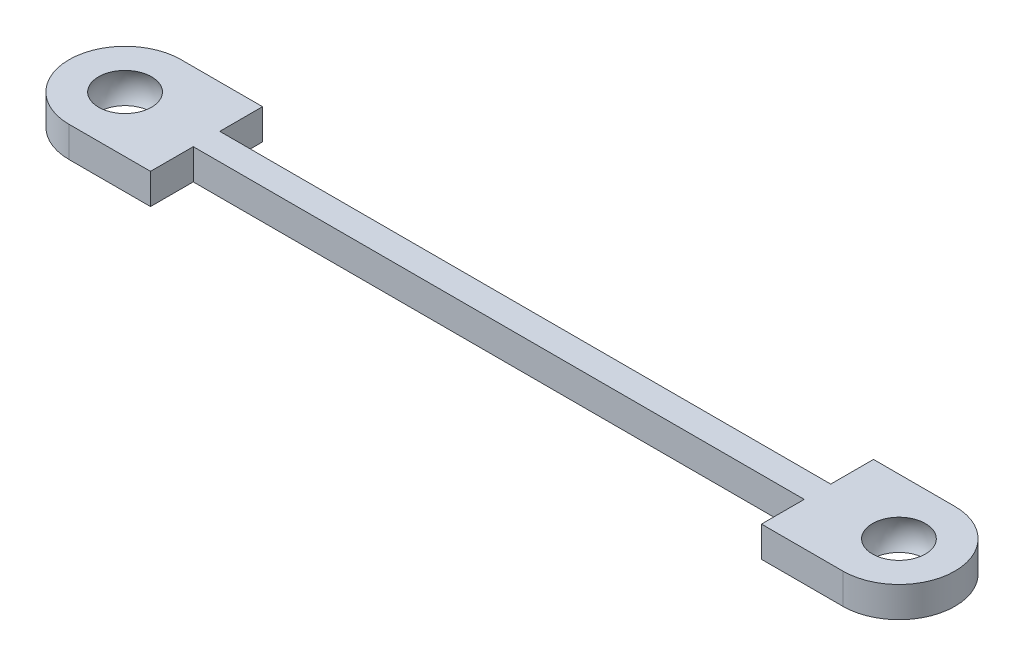
ISO-10303-21;
HEADER;
FILE_DESCRIPTION(('STEP AP214'),'2;1');
FILE_NAME('part.step','',(''),(''),'','','');
FILE_SCHEMA(('AUTOMOTIVE_DESIGN { 1 0 10303 214 1 1 1 1 }'));
ENDSEC;
DATA;
#1=APPLICATION_CONTEXT('core data for automotive mechanical design processes');
#2=APPLICATION_PROTOCOL_DEFINITION('international standard','automotive_design',2000,#1);
#3=PRODUCT_CONTEXT('',#1,'mechanical');
#4=PRODUCT('Part','Part','',(#3));
#5=PRODUCT_RELATED_PRODUCT_CATEGORY('part','',(#4));
#6=PRODUCT_DEFINITION_FORMATION('','',#4);
#7=PRODUCT_DEFINITION_CONTEXT('part definition',#1,'design');
#8=PRODUCT_DEFINITION('design','',#6,#7);
#9=PRODUCT_DEFINITION_SHAPE('','',#8);
#10=(LENGTH_UNIT() NAMED_UNIT(*) SI_UNIT(.MILLI.,.METRE.));
#11=(NAMED_UNIT(*) PLANE_ANGLE_UNIT() SI_UNIT($,.RADIAN.));
#12=(NAMED_UNIT(*) SI_UNIT($,.STERADIAN.) SOLID_ANGLE_UNIT());
#13=UNCERTAINTY_MEASURE_WITH_UNIT(LENGTH_MEASURE(1.E-05),#10,'distance_accuracy_value','');
#14=(GEOMETRIC_REPRESENTATION_CONTEXT(3) GLOBAL_UNCERTAINTY_ASSIGNED_CONTEXT((#13)) GLOBAL_UNIT_ASSIGNED_CONTEXT((#10,
#11,#12)) REPRESENTATION_CONTEXT('',''));
#15=CARTESIAN_POINT('',(0.,0.,0.));
#16=DIRECTION('',(0.,0.,1.));
#17=DIRECTION('',(1.,0.,0.));
#18=AXIS2_PLACEMENT_3D('',#15,#16,#17);
#19=CARTESIAN_POINT('',(-34.2458565516778,-0.75,-2.75));
#20=DIRECTION('',(0.,0.,1.));
#21=DIRECTION('',(1.,0.,0.));
#22=AXIS2_PLACEMENT_3D('',#19,#20,#21);
#23=PLANE('',#22);
#24=DIRECTION('',(0.,1.,0.));
#25=VECTOR('',#24,1.);
#26=CARTESIAN_POINT('',(-19.,-0.75,-2.75));
#27=LINE('',#26,#25);
#28=CARTESIAN_POINT('',(-19.,-0.75,-2.75));
#29=VERTEX_POINT('',#28);
#30=CARTESIAN_POINT('',(-19.,0.75,-2.75));
#31=VERTEX_POINT('',#30);
#32=EDGE_CURVE('E133',#29,#31,#27,.T.);
#33=ORIENTED_EDGE('',*,*,#32,.T.);
#34=DIRECTION('',(1.,0.,0.));
#35=VECTOR('',#34,1.);
#36=CARTESIAN_POINT('',(-34.2458565516778,0.75,-2.75));
#37=LINE('',#36,#35);
#38=CARTESIAN_POINT('',(-15.,0.75,-2.75));
#39=VERTEX_POINT('',#38);
#40=EDGE_CURVE('E136',#31,#39,#37,.T.);
#41=ORIENTED_EDGE('',*,*,#40,.T.);
#42=DIRECTION('',(0.,1.,0.));
#43=VECTOR('',#42,1.);
#44=CARTESIAN_POINT('',(-15.,-0.75,-2.75));
#45=LINE('',#44,#43);
#46=CARTESIAN_POINT('',(-15.,-0.75,-2.75));
#47=VERTEX_POINT('',#46);
#48=EDGE_CURVE('E12',#47,#39,#45,.T.);
#49=ORIENTED_EDGE('',*,*,#48,.F.);
#50=DIRECTION('',(1.,0.,0.));
#51=VECTOR('',#50,1.);
#52=CARTESIAN_POINT('',(-34.2458565516778,-0.75,-2.75));
#53=LINE('',#52,#51);
#54=EDGE_CURVE('E59',#29,#47,#53,.T.);
#55=ORIENTED_EDGE('',*,*,#54,.F.);
#56=EDGE_LOOP('',(#33,#41,#49,#55));
#57=FACE_BOUND('',#56,.T.);
#58=ADVANCED_FACE('F43',(#57),#23,.F.);
#59=CARTESIAN_POINT('',(-15.,-0.75,0.));
#60=DIRECTION('',(1.,0.,0.));
#61=DIRECTION('',(0.,0.,-1.));
#62=AXIS2_PLACEMENT_3D('',#59,#60,#61);
#63=PLANE('',#62);
#64=ORIENTED_EDGE('',*,*,#48,.T.);
#65=DIRECTION('',(0.,0.,-1.));
#66=VECTOR('',#65,1.);
#67=CARTESIAN_POINT('',(-15.,0.75,0.));
#68=LINE('',#67,#66);
#69=CARTESIAN_POINT('',(-15.,0.75,-0.650720727120628));
#70=VERTEX_POINT('',#69);
#71=EDGE_CURVE('E153',#70,#39,#68,.T.);
#72=ORIENTED_EDGE('',*,*,#71,.F.);
#73=DIRECTION('',(0.,1.,0.));
#74=VECTOR('',#73,1.);
#75=CARTESIAN_POINT('',(-15.,-0.75,-0.650720727120628));
#76=LINE('',#75,#74);
#77=CARTESIAN_POINT('',(-15.,-0.75,-0.650720727120628));
#78=VERTEX_POINT('',#77);
#79=EDGE_CURVE('E51',#78,#70,#76,.T.);
#80=ORIENTED_EDGE('',*,*,#79,.F.);
#81=DIRECTION('',(0.,0.,-1.));
#82=VECTOR('',#81,1.);
#83=CARTESIAN_POINT('',(-15.,-0.75,0.));
#84=LINE('',#83,#82);
#85=EDGE_CURVE('E140',#78,#47,#84,.T.);
#86=ORIENTED_EDGE('',*,*,#85,.T.);
#87=EDGE_LOOP('',(#64,#72,#80,#86));
#88=FACE_BOUND('',#87,.T.);
#89=ADVANCED_FACE('F251',(#88),#63,.T.);
#90=CARTESIAN_POINT('',(-34.2458565516778,-0.75,-0.650720727120628));
#91=DIRECTION('',(0.,0.,1.));
#92=DIRECTION('',(1.,0.,0.));
#93=AXIS2_PLACEMENT_3D('',#90,#91,#92);
#94=PLANE('',#93);
#95=ORIENTED_EDGE('',*,*,#79,.T.);
#96=DIRECTION('',(1.,0.,0.));
#97=VECTOR('',#96,1.);
#98=CARTESIAN_POINT('',(-34.2458565516778,0.75,-0.650720727120628));
#99=LINE('',#98,#97);
#100=CARTESIAN_POINT('',(15.,0.75,-0.650720727120628));
#101=VERTEX_POINT('',#100);
#102=EDGE_CURVE('E181',#70,#101,#99,.T.);
#103=ORIENTED_EDGE('',*,*,#102,.T.);
#104=DIRECTION('',(0.,1.,0.));
#105=VECTOR('',#104,1.);
#106=CARTESIAN_POINT('',(15.,-0.75,-0.650720727120628));
#107=LINE('',#106,#105);
#108=CARTESIAN_POINT('',(15.,-0.75,-0.650720727120628));
#109=VERTEX_POINT('',#108);
#110=EDGE_CURVE('E210',#109,#101,#107,.T.);
#111=ORIENTED_EDGE('',*,*,#110,.F.);
#112=DIRECTION('',(1.,0.,0.));
#113=VECTOR('',#112,1.);
#114=CARTESIAN_POINT('',(-34.2458565516778,-0.75,-0.650720727120628));
#115=LINE('',#114,#113);
#116=EDGE_CURVE('E207',#78,#109,#115,.T.);
#117=ORIENTED_EDGE('',*,*,#116,.F.);
#118=EDGE_LOOP('',(#95,#103,#111,#117));
#119=FACE_BOUND('',#118,.T.);
#120=ADVANCED_FACE('F255',(#119),#94,.F.);
#121=CARTESIAN_POINT('',(15.,-0.75,0.));
#122=DIRECTION('',(1.,0.,0.));
#123=DIRECTION('',(0.,0.,-1.));
#124=AXIS2_PLACEMENT_3D('',#121,#122,#123);
#125=PLANE('',#124);
#126=ORIENTED_EDGE('',*,*,#110,.T.);
#127=DIRECTION('',(0.,0.,-1.));
#128=VECTOR('',#127,1.);
#129=CARTESIAN_POINT('',(15.,0.75,0.));
#130=LINE('',#129,#128);
#131=CARTESIAN_POINT('',(15.,0.75,-2.75000000000001));
#132=VERTEX_POINT('',#131);
#133=EDGE_CURVE('E172',#101,#132,#130,.T.);
#134=ORIENTED_EDGE('',*,*,#133,.T.);
#135=DIRECTION('',(0.,1.,0.));
#136=VECTOR('',#135,1.);
#137=CARTESIAN_POINT('',(15.,-0.75,-2.75000000000001));
#138=LINE('',#137,#136);
#139=CARTESIAN_POINT('',(15.,-0.75,-2.75000000000001));
#140=VERTEX_POINT('',#139);
#141=EDGE_CURVE('E212',#140,#132,#138,.T.);
#142=ORIENTED_EDGE('',*,*,#141,.F.);
#143=DIRECTION('',(0.,0.,-1.));
#144=VECTOR('',#143,1.);
#145=CARTESIAN_POINT('',(15.,-0.75,0.));
#146=LINE('',#145,#144);
#147=EDGE_CURVE('E199',#109,#140,#146,.T.);
#148=ORIENTED_EDGE('',*,*,#147,.F.);
#149=EDGE_LOOP('',(#126,#134,#142,#148));
#150=FACE_BOUND('',#149,.T.);
#151=ADVANCED_FACE('F261',(#150),#125,.F.);
#152=CARTESIAN_POINT('',(-34.2458565516778,-0.75,-2.75));
#153=DIRECTION('',(0.,0.,1.));
#154=DIRECTION('',(1.,0.,0.));
#155=AXIS2_PLACEMENT_3D('',#152,#153,#154);
#156=PLANE('',#155);
#157=ORIENTED_EDGE('',*,*,#141,.T.);
#158=DIRECTION('',(1.,0.,0.));
#159=VECTOR('',#158,1.);
#160=CARTESIAN_POINT('',(-34.2458565516778,0.75,-2.75));
#161=LINE('',#160,#159);
#162=CARTESIAN_POINT('',(19.,0.75,-2.75000000000001));
#163=VERTEX_POINT('',#162);
#164=EDGE_CURVE('E178',#132,#163,#161,.T.);
#165=ORIENTED_EDGE('',*,*,#164,.T.);
#166=DIRECTION('',(0.,1.,0.));
#167=VECTOR('',#166,1.);
#168=CARTESIAN_POINT('',(19.,-0.75,-2.75000000000001));
#169=LINE('',#168,#167);
#170=CARTESIAN_POINT('',(19.,-0.75,-2.75000000000001));
#171=VERTEX_POINT('',#170);
#172=EDGE_CURVE('E214',#171,#163,#169,.T.);
#173=ORIENTED_EDGE('',*,*,#172,.F.);
#174=DIRECTION('',(1.,0.,0.));
#175=VECTOR('',#174,1.);
#176=CARTESIAN_POINT('',(-34.2458565516778,-0.75,-2.75));
#177=LINE('',#176,#175);
#178=EDGE_CURVE('E205',#140,#171,#177,.T.);
#179=ORIENTED_EDGE('',*,*,#178,.F.);
#180=EDGE_LOOP('',(#157,#165,#173,#179));
#181=FACE_BOUND('',#180,.T.);
#182=ADVANCED_FACE('F296',(#181),#156,.F.);
#183=CARTESIAN_POINT('',(19.,-0.75,0.));
#184=DIRECTION('',(0.,1.,0.));
#185=DIRECTION('',(0.,0.,1.));
#186=AXIS2_PLACEMENT_3D('',#183,#184,#185);
#187=CYLINDRICAL_SURFACE('',#186,2.75);
#188=ORIENTED_EDGE('',*,*,#172,.T.);
#189=CARTESIAN_POINT('',(19.,0.75,0.));
#190=DIRECTION('',(0.,1.,0.));
#191=DIRECTION('',(0.,0.,1.));
#192=AXIS2_PLACEMENT_3D('',#189,#190,#191);
#193=CIRCLE('',#192,2.75);
#194=CARTESIAN_POINT('',(19.,0.75,2.74999999999999));
#195=VERTEX_POINT('',#194);
#196=EDGE_CURVE('E175',#195,#163,#193,.T.);
#197=ORIENTED_EDGE('',*,*,#196,.F.);
#198=DIRECTION('',(0.,1.,0.));
#199=VECTOR('',#198,1.);
#200=CARTESIAN_POINT('',(19.,-0.75,2.74999999999999));
#201=LINE('',#200,#199);
#202=CARTESIAN_POINT('',(19.,-0.75,2.74999999999999));
#203=VERTEX_POINT('',#202);
#204=EDGE_CURVE('E216',#203,#195,#201,.T.);
#205=ORIENTED_EDGE('',*,*,#204,.F.);
#206=CARTESIAN_POINT('',(19.,-0.75,0.));
#207=DIRECTION('',(0.,1.,0.));
#208=DIRECTION('',(0.,0.,1.));
#209=AXIS2_PLACEMENT_3D('',#206,#207,#208);
#210=CIRCLE('',#209,2.75);
#211=EDGE_CURVE('E202',#203,#171,#210,.T.);
#212=ORIENTED_EDGE('',*,*,#211,.T.);
#213=EDGE_LOOP('',(#188,#197,#205,#212));
#214=FACE_BOUND('',#213,.T.);
#215=ADVANCED_FACE('F291',(#214),#187,.T.);
#216=CARTESIAN_POINT('',(-34.2458565516778,-0.75,2.75));
#217=DIRECTION('',(0.,0.,1.));
#218=DIRECTION('',(1.,0.,0.));
#219=AXIS2_PLACEMENT_3D('',#216,#217,#218);
#220=PLANE('',#219);
#221=ORIENTED_EDGE('',*,*,#204,.T.);
#222=DIRECTION('',(1.,0.,0.));
#223=VECTOR('',#222,1.);
#224=CARTESIAN_POINT('',(-34.2458565516778,0.75,2.75));
#225=LINE('',#224,#223);
#226=CARTESIAN_POINT('',(15.,0.75,2.74999999999999));
#227=VERTEX_POINT('',#226);
#228=EDGE_CURVE('E171',#227,#195,#225,.T.);
#229=ORIENTED_EDGE('',*,*,#228,.F.);
#230=DIRECTION('',(0.,1.,0.));
#231=VECTOR('',#230,1.);
#232=CARTESIAN_POINT('',(15.,-0.75,2.74999999999999));
#233=LINE('',#232,#231);
#234=CARTESIAN_POINT('',(15.,-0.75,2.74999999999999));
#235=VERTEX_POINT('',#234);
#236=EDGE_CURVE('E218',#235,#227,#233,.T.);
#237=ORIENTED_EDGE('',*,*,#236,.F.);
#238=DIRECTION('',(1.,0.,0.));
#239=VECTOR('',#238,1.);
#240=CARTESIAN_POINT('',(-34.2458565516778,-0.75,2.75));
#241=LINE('',#240,#239);
#242=EDGE_CURVE('E198',#235,#203,#241,.T.);
#243=ORIENTED_EDGE('',*,*,#242,.T.);
#244=EDGE_LOOP('',(#221,#229,#237,#243));
#245=FACE_BOUND('',#244,.T.);
#246=ADVANCED_FACE('F303',(#245),#220,.T.);
#247=ORIENTED_EDGE('',*,*,#236,.T.);
#248=CARTESIAN_POINT('',(15.,0.75,0.650720727120628));
#249=VERTEX_POINT('',#248);
#250=EDGE_CURVE('E168',#227,#249,#130,.T.);
#251=ORIENTED_EDGE('',*,*,#250,.T.);
#252=DIRECTION('',(0.,1.,0.));
#253=VECTOR('',#252,1.);
#254=CARTESIAN_POINT('',(15.,-0.75,0.650720727120628));
#255=LINE('',#254,#253);
#256=CARTESIAN_POINT('',(15.,-0.75,0.650720727120628));
#257=VERTEX_POINT('',#256);
#258=EDGE_CURVE('E220',#257,#249,#255,.T.);
#259=ORIENTED_EDGE('',*,*,#258,.F.);
#260=EDGE_CURVE('E196',#235,#257,#146,.T.);
#261=ORIENTED_EDGE('',*,*,#260,.F.);
#262=EDGE_LOOP('',(#247,#251,#259,#261));
#263=FACE_BOUND('',#262,.T.);
#264=ADVANCED_FACE('F274',(#263),#125,.F.);
#265=CARTESIAN_POINT('',(-34.2458565516778,-0.75,0.650720727120628));
#266=DIRECTION('',(0.,0.,1.));
#267=DIRECTION('',(1.,0.,0.));
#268=AXIS2_PLACEMENT_3D('',#265,#266,#267);
#269=PLANE('',#268);
#270=ORIENTED_EDGE('',*,*,#258,.T.);
#271=DIRECTION('',(1.,0.,0.));
#272=VECTOR('',#271,1.);
#273=CARTESIAN_POINT('',(-34.2458565516778,0.75,0.650720727120628));
#274=LINE('',#273,#272);
#275=CARTESIAN_POINT('',(-15.,0.75,0.650720727120628));
#276=VERTEX_POINT('',#275);
#277=EDGE_CURVE('E165',#276,#249,#274,.T.);
#278=ORIENTED_EDGE('',*,*,#277,.F.);
#279=DIRECTION('',(0.,1.,0.));
#280=VECTOR('',#279,1.);
#281=CARTESIAN_POINT('',(-15.,-0.75,0.650720727120628));
#282=LINE('',#281,#280);
#283=CARTESIAN_POINT('',(-15.,-0.75,0.650720727120628));
#284=VERTEX_POINT('',#283);
#285=EDGE_CURVE('E222',#284,#276,#282,.T.);
#286=ORIENTED_EDGE('',*,*,#285,.F.);
#287=DIRECTION('',(1.,0.,0.));
#288=VECTOR('',#287,1.);
#289=CARTESIAN_POINT('',(-34.2458565516778,-0.75,0.650720727120628));
#290=LINE('',#289,#288);
#291=EDGE_CURVE('E193',#284,#257,#290,.T.);
#292=ORIENTED_EDGE('',*,*,#291,.T.);
#293=EDGE_LOOP('',(#270,#278,#286,#292));
#294=FACE_BOUND('',#293,.T.);
#295=ADVANCED_FACE('F266',(#294),#269,.T.);
#296=ORIENTED_EDGE('',*,*,#285,.T.);
#297=CARTESIAN_POINT('',(-15.,0.75,2.75));
#298=VERTEX_POINT('',#297);
#299=EDGE_CURVE('E162',#298,#276,#68,.T.);
#300=ORIENTED_EDGE('',*,*,#299,.F.);
#301=DIRECTION('',(0.,1.,0.));
#302=VECTOR('',#301,1.);
#303=CARTESIAN_POINT('',(-15.,-0.75,2.75));
#304=LINE('',#303,#302);
#305=CARTESIAN_POINT('',(-15.,-0.75,2.75));
#306=VERTEX_POINT('',#305);
#307=EDGE_CURVE('E224',#306,#298,#304,.T.);
#308=ORIENTED_EDGE('',*,*,#307,.F.);
#309=EDGE_CURVE('E190',#306,#284,#84,.T.);
#310=ORIENTED_EDGE('',*,*,#309,.T.);
#311=EDGE_LOOP('',(#296,#300,#308,#310));
#312=FACE_BOUND('',#311,.T.);
#313=ADVANCED_FACE('F257',(#312),#63,.T.);
#314=CARTESIAN_POINT('',(-34.2458565516778,-0.75,2.75));
#315=DIRECTION('',(0.,0.,1.));
#316=DIRECTION('',(1.,0.,0.));
#317=AXIS2_PLACEMENT_3D('',#314,#315,#316);
#318=PLANE('',#317);
#319=ORIENTED_EDGE('',*,*,#307,.T.);
#320=DIRECTION('',(1.,0.,0.));
#321=VECTOR('',#320,1.);
#322=CARTESIAN_POINT('',(-34.2458565516778,0.75,2.75));
#323=LINE('',#322,#321);
#324=CARTESIAN_POINT('',(-19.,0.75,2.75));
#325=VERTEX_POINT('',#324);
#326=EDGE_CURVE('E148',#325,#298,#323,.T.);
#327=ORIENTED_EDGE('',*,*,#326,.F.);
#328=DIRECTION('',(0.,1.,0.));
#329=VECTOR('',#328,1.);
#330=CARTESIAN_POINT('',(-19.,-0.75,2.75));
#331=LINE('',#330,#329);
#332=CARTESIAN_POINT('',(-19.,-0.75,2.75));
#333=VERTEX_POINT('',#332);
#334=EDGE_CURVE('E139',#333,#325,#331,.T.);
#335=ORIENTED_EDGE('',*,*,#334,.F.);
#336=DIRECTION('',(1.,0.,0.));
#337=VECTOR('',#336,1.);
#338=CARTESIAN_POINT('',(-34.2458565516778,-0.75,2.75));
#339=LINE('',#338,#337);
#340=EDGE_CURVE('E187',#333,#306,#339,.T.);
#341=ORIENTED_EDGE('',*,*,#340,.T.);
#342=EDGE_LOOP('',(#319,#327,#335,#341));
#343=FACE_BOUND('',#342,.T.);
#344=ADVANCED_FACE('F265',(#343),#318,.T.);
#345=CARTESIAN_POINT('',(-19.,-0.75,0.));
#346=DIRECTION('',(0.,1.,0.));
#347=DIRECTION('',(0.,0.,1.));
#348=AXIS2_PLACEMENT_3D('',#345,#346,#347);
#349=CYLINDRICAL_SURFACE('',#348,2.75);
#350=ORIENTED_EDGE('',*,*,#334,.T.);
#351=CARTESIAN_POINT('',(-19.,0.75,0.));
#352=DIRECTION('',(0.,1.,0.));
#353=DIRECTION('',(0.,0.,1.));
#354=AXIS2_PLACEMENT_3D('',#351,#352,#353);
#355=CIRCLE('',#354,2.75);
#356=EDGE_CURVE('E143',#31,#325,#355,.T.);
#357=ORIENTED_EDGE('',*,*,#356,.F.);
#358=ORIENTED_EDGE('',*,*,#32,.F.);
#359=CARTESIAN_POINT('',(-19.,-0.75,0.));
#360=DIRECTION('',(0.,1.,0.));
#361=DIRECTION('',(0.,0.,1.));
#362=AXIS2_PLACEMENT_3D('',#359,#360,#361);
#363=CIRCLE('',#362,2.75);
#364=EDGE_CURVE('E185',#29,#333,#363,.T.);
#365=ORIENTED_EDGE('',*,*,#364,.T.);
#366=EDGE_LOOP('',(#350,#357,#358,#365));
#367=FACE_BOUND('',#366,.T.);
#368=ADVANCED_FACE('F144',(#367),#349,.T.);
#369=CARTESIAN_POINT('',(-34.2458565516778,-0.75,0.));
#370=DIRECTION('',(0.,1.,0.));
#371=DIRECTION('',(0.,0.,1.));
#372=AXIS2_PLACEMENT_3D('',#369,#370,#371);
#373=PLANE('',#372);
#374=CARTESIAN_POINT('',(19.,-0.75,0.));
#375=DIRECTION('',(0.,1.,0.));
#376=DIRECTION('',(0.,0.,1.));
#377=AXIS2_PLACEMENT_3D('',#374,#375,#376);
#378=CIRCLE('',#377,1.29903810567666);
#379=CARTESIAN_POINT('',(19.,-0.75,1.29903810567666));
#380=VERTEX_POINT('',#379);
#381=EDGE_CURVE('E227',#380,#380,#378,.T.);
#382=ORIENTED_EDGE('',*,*,#381,.T.);
#383=EDGE_LOOP('',(#382));
#384=FACE_BOUND('',#383,.T.);
#385=CARTESIAN_POINT('',(-19.,-0.75,0.));
#386=DIRECTION('',(0.,1.,0.));
#387=DIRECTION('',(0.,0.,1.));
#388=AXIS2_PLACEMENT_3D('',#385,#386,#387);
#389=CIRCLE('',#388,1.29903810567666);
#390=CARTESIAN_POINT('',(-19.,-0.75,1.29903810567666));
#391=VERTEX_POINT('',#390);
#392=EDGE_CURVE('E154',#391,#391,#389,.T.);
#393=ORIENTED_EDGE('',*,*,#392,.T.);
#394=EDGE_LOOP('',(#393));
#395=FACE_BOUND('',#394,.T.);
#396=ORIENTED_EDGE('',*,*,#54,.T.);
#397=ORIENTED_EDGE('',*,*,#85,.F.);
#398=ORIENTED_EDGE('',*,*,#116,.T.);
#399=ORIENTED_EDGE('',*,*,#147,.T.);
#400=ORIENTED_EDGE('',*,*,#178,.T.);
#401=ORIENTED_EDGE('',*,*,#211,.F.);
#402=ORIENTED_EDGE('',*,*,#242,.F.);
#403=ORIENTED_EDGE('',*,*,#260,.T.);
#404=ORIENTED_EDGE('',*,*,#291,.F.);
#405=ORIENTED_EDGE('',*,*,#309,.F.);
#406=ORIENTED_EDGE('',*,*,#340,.F.);
#407=ORIENTED_EDGE('',*,*,#364,.F.);
#408=EDGE_LOOP('',(#396,#397,#398,#399,#400,#401,#402,#403,#404,#405,#406,#407));
#409=FACE_BOUND('',#408,.T.);
#410=ADVANCED_FACE('F242',(#384,#395,#409),#373,.F.);
#411=CARTESIAN_POINT('',(-34.2458565516778,0.75,0.));
#412=DIRECTION('',(0.,1.,0.));
#413=DIRECTION('',(0.,0.,1.));
#414=AXIS2_PLACEMENT_3D('',#411,#412,#413);
#415=PLANE('',#414);
#416=CARTESIAN_POINT('',(19.,0.75,0.));
#417=DIRECTION('',(0.,1.,0.));
#418=DIRECTION('',(0.,0.,1.));
#419=AXIS2_PLACEMENT_3D('',#416,#417,#418);
#420=CIRCLE('',#419,1.29903810567666);
#421=CARTESIAN_POINT('',(19.,0.75,1.29903810567666));
#422=VERTEX_POINT('',#421);
#423=EDGE_CURVE('E46',#422,#422,#420,.T.);
#424=ORIENTED_EDGE('',*,*,#423,.F.);
#425=EDGE_LOOP('',(#424));
#426=FACE_BOUND('',#425,.T.);
#427=CARTESIAN_POINT('',(-19.,0.75,0.));
#428=DIRECTION('',(0.,1.,0.));
#429=DIRECTION('',(0.,0.,1.));
#430=AXIS2_PLACEMENT_3D('',#427,#428,#429);
#431=CIRCLE('',#430,1.29903810567666);
#432=CARTESIAN_POINT('',(-19.,0.75,1.29903810567666));
#433=VERTEX_POINT('',#432);
#434=EDGE_CURVE('E157',#433,#433,#431,.T.);
#435=ORIENTED_EDGE('',*,*,#434,.F.);
#436=EDGE_LOOP('',(#435));
#437=FACE_BOUND('',#436,.T.);
#438=ORIENTED_EDGE('',*,*,#40,.F.);
#439=ORIENTED_EDGE('',*,*,#356,.T.);
#440=ORIENTED_EDGE('',*,*,#326,.T.);
#441=ORIENTED_EDGE('',*,*,#299,.T.);
#442=ORIENTED_EDGE('',*,*,#277,.T.);
#443=ORIENTED_EDGE('',*,*,#250,.F.);
#444=ORIENTED_EDGE('',*,*,#228,.T.);
#445=ORIENTED_EDGE('',*,*,#196,.T.);
#446=ORIENTED_EDGE('',*,*,#164,.F.);
#447=ORIENTED_EDGE('',*,*,#133,.F.);
#448=ORIENTED_EDGE('',*,*,#102,.F.);
#449=ORIENTED_EDGE('',*,*,#71,.T.);
#450=EDGE_LOOP('',(#438,#439,#440,#441,#442,#443,#444,#445,#446,#447,#448,#449));
#451=FACE_BOUND('',#450,.T.);
#452=ADVANCED_FACE('F151',(#426,#437,#451),#415,.T.);
#453=CARTESIAN_POINT('',(-19.,0.,0.));
#454=DIRECTION('',(-1.,0.,0.));
#455=DIRECTION('',(0.,0.,-1.));
#456=AXIS2_PLACEMENT_3D('',#453,#454,#455);
#457=SPHERICAL_SURFACE('',#456,1.5);
#458=CARTESIAN_POINT('',(-19.,0.,0.));
#459=DIRECTION('',(0.,1.,0.));
#460=DIRECTION('',(0.,0.,1.));
#461=AXIS2_PLACEMENT_3D('',#458,#459,#460);
#462=SPHERICAL_SURFACE('',#461,1.5);
#463=ORIENTED_EDGE('',*,*,#434,.T.);
#464=EDGE_LOOP('',(#463));
#465=FACE_BOUND('',#464,.T.);
#466=ORIENTED_EDGE('',*,*,#392,.F.);
#467=EDGE_LOOP('',(#466));
#468=FACE_BOUND('',#467,.T.);
#469=ADVANCED_FACE('F241',(#465,#468),#462,.F.);
#470=CARTESIAN_POINT('',(19.,0.,0.));
#471=DIRECTION('',(-1.,0.,0.));
#472=DIRECTION('',(0.,0.,1.));
#473=AXIS2_PLACEMENT_3D('',#470,#471,#472);
#474=SPHERICAL_SURFACE('',#473,1.5);
#475=CARTESIAN_POINT('',(19.,0.,0.));
#476=DIRECTION('',(0.,1.,0.));
#477=DIRECTION('',(0.,0.,1.));
#478=AXIS2_PLACEMENT_3D('',#475,#476,#477);
#479=SPHERICAL_SURFACE('',#478,1.5);
#480=ORIENTED_EDGE('',*,*,#423,.T.);
#481=EDGE_LOOP('',(#480));
#482=FACE_BOUND('',#481,.T.);
#483=ORIENTED_EDGE('',*,*,#381,.F.);
#484=EDGE_LOOP('',(#483));
#485=FACE_BOUND('',#484,.T.);
#486=ADVANCED_FACE('F236',(#482,#485),#479,.F.);
#487=CLOSED_SHELL('',(#58,#89,#120,#151,#182,#215,#246,#264,#295,#313,#344,#368,#410,#452,#469,#486));
#488=MANIFOLD_SOLID_BREP('B2',#487);
#489=ADVANCED_BREP_SHAPE_REPRESENTATION('',(#18,#488),#14);
#490=SHAPE_DEFINITION_REPRESENTATION(#9,#489);
ENDSEC;
END-ISO-10303-21;
